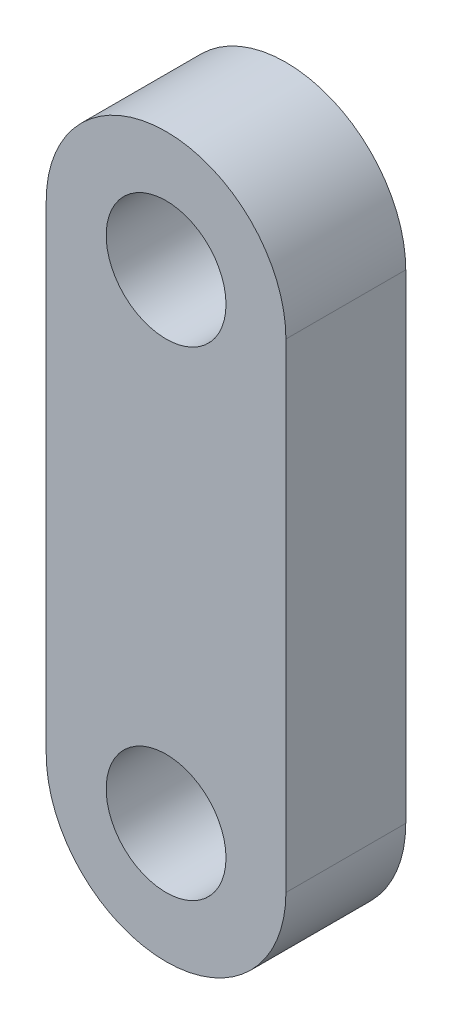
ISO-10303-21;
HEADER;
FILE_DESCRIPTION(('STEP AP214'),'2;1');
FILE_NAME('part.step','',(''),(''),'','','');
FILE_SCHEMA(('AUTOMOTIVE_DESIGN { 1 0 10303 214 1 1 1 1 }'));
ENDSEC;
DATA;
#1=APPLICATION_CONTEXT('core data for automotive mechanical design processes');
#2=APPLICATION_PROTOCOL_DEFINITION('international standard','automotive_design',2000,#1);
#3=PRODUCT_CONTEXT('',#1,'mechanical');
#4=PRODUCT('Part','Part','',(#3));
#5=PRODUCT_RELATED_PRODUCT_CATEGORY('part','',(#4));
#6=PRODUCT_DEFINITION_FORMATION('','',#4);
#7=PRODUCT_DEFINITION_CONTEXT('part definition',#1,'design');
#8=PRODUCT_DEFINITION('design','',#6,#7);
#9=PRODUCT_DEFINITION_SHAPE('','',#8);
#10=(LENGTH_UNIT() NAMED_UNIT(*) SI_UNIT(.MILLI.,.METRE.));
#11=(NAMED_UNIT(*) PLANE_ANGLE_UNIT() SI_UNIT($,.RADIAN.));
#12=(NAMED_UNIT(*) SI_UNIT($,.STERADIAN.) SOLID_ANGLE_UNIT());
#13=UNCERTAINTY_MEASURE_WITH_UNIT(LENGTH_MEASURE(1.E-05),#10,'distance_accuracy_value','');
#14=(GEOMETRIC_REPRESENTATION_CONTEXT(3) GLOBAL_UNCERTAINTY_ASSIGNED_CONTEXT((#13)) GLOBAL_UNIT_ASSIGNED_CONTEXT((#10,
#11,#12)) REPRESENTATION_CONTEXT('',''));
#15=CARTESIAN_POINT('',(0.,0.,0.));
#16=DIRECTION('',(0.,0.,1.));
#17=DIRECTION('',(1.,0.,0.));
#18=AXIS2_PLACEMENT_3D('',#15,#16,#17);
#19=CARTESIAN_POINT('',(0.,25.4,6.35));
#20=DIRECTION('',(0.,0.,1.));
#21=DIRECTION('',(1.,0.,0.));
#22=AXIS2_PLACEMENT_3D('',#19,#20,#21);
#23=PLANE('',#22);
#24=CARTESIAN_POINT('',(0.,0.,6.35));
#25=DIRECTION('',(0.,0.,1.));
#26=DIRECTION('',(1.,0.,0.));
#27=AXIS2_PLACEMENT_3D('',#24,#25,#26);
#28=CIRCLE('',#27,3.175);
#29=CARTESIAN_POINT('',(3.175,0.,6.35));
#30=VERTEX_POINT('',#29);
#31=EDGE_CURVE('E116',#30,#30,#28,.T.);
#32=ORIENTED_EDGE('',*,*,#31,.F.);
#33=EDGE_LOOP('',(#32));
#34=FACE_BOUND('',#33,.T.);
#35=CARTESIAN_POINT('',(0.,25.4,6.35));
#36=DIRECTION('',(0.,0.,1.));
#37=DIRECTION('',(1.,0.,0.));
#38=AXIS2_PLACEMENT_3D('',#35,#36,#37);
#39=CIRCLE('',#38,6.35);
#40=CARTESIAN_POINT('',(6.35,25.4,6.35));
#41=VERTEX_POINT('',#40);
#42=CARTESIAN_POINT('',(-6.35,25.4,6.35));
#43=VERTEX_POINT('',#42);
#44=EDGE_CURVE('E96',#41,#43,#39,.T.);
#45=ORIENTED_EDGE('',*,*,#44,.T.);
#46=DIRECTION('',(0.,-1.,0.));
#47=VECTOR('',#46,1.);
#48=CARTESIAN_POINT('',(-6.35,25.4,6.35));
#49=LINE('',#48,#47);
#50=CARTESIAN_POINT('',(-6.35,0.,6.35));
#51=VERTEX_POINT('',#50);
#52=EDGE_CURVE('E91',#43,#51,#49,.T.);
#53=ORIENTED_EDGE('',*,*,#52,.T.);
#54=CARTESIAN_POINT('',(0.,0.,6.35));
#55=DIRECTION('',(0.,0.,1.));
#56=DIRECTION('',(1.,0.,0.));
#57=AXIS2_PLACEMENT_3D('',#54,#55,#56);
#58=CIRCLE('',#57,6.35);
#59=CARTESIAN_POINT('',(6.35,0.,6.35));
#60=VERTEX_POINT('',#59);
#61=EDGE_CURVE('E94',#51,#60,#58,.T.);
#62=ORIENTED_EDGE('',*,*,#61,.T.);
#63=DIRECTION('',(0.,1.,0.));
#64=VECTOR('',#63,1.);
#65=CARTESIAN_POINT('',(6.35,25.4,6.35));
#66=LINE('',#65,#64);
#67=EDGE_CURVE('E61',#60,#41,#66,.T.);
#68=ORIENTED_EDGE('',*,*,#67,.T.);
#69=EDGE_LOOP('',(#45,#53,#62,#68));
#70=FACE_BOUND('',#69,.T.);
#71=CARTESIAN_POINT('',(0.,25.4,6.35));
#72=DIRECTION('',(0.,0.,1.));
#73=DIRECTION('',(1.,0.,0.));
#74=AXIS2_PLACEMENT_3D('',#71,#72,#73);
#75=CIRCLE('',#74,3.175);
#76=CARTESIAN_POINT('',(3.175,25.4,6.35));
#77=VERTEX_POINT('',#76);
#78=EDGE_CURVE('E138',#77,#77,#75,.T.);
#79=ORIENTED_EDGE('',*,*,#78,.F.);
#80=EDGE_LOOP('',(#79));
#81=FACE_BOUND('',#80,.T.);
#82=ADVANCED_FACE('F43',(#34,#70,#81),#23,.T.);
#83=CARTESIAN_POINT('',(0.,25.4,0.));
#84=DIRECTION('',(0.,0.,1.));
#85=DIRECTION('',(1.,0.,0.));
#86=AXIS2_PLACEMENT_3D('',#83,#84,#85);
#87=PLANE('',#86);
#88=CARTESIAN_POINT('',(0.,25.4,0.));
#89=DIRECTION('',(0.,0.,1.));
#90=DIRECTION('',(1.,0.,0.));
#91=AXIS2_PLACEMENT_3D('',#88,#89,#90);
#92=CIRCLE('',#91,6.35);
#93=CARTESIAN_POINT('',(6.35,25.4,0.));
#94=VERTEX_POINT('',#93);
#95=CARTESIAN_POINT('',(-6.35,25.4,0.));
#96=VERTEX_POINT('',#95);
#97=EDGE_CURVE('E112',#94,#96,#92,.T.);
#98=ORIENTED_EDGE('',*,*,#97,.F.);
#99=DIRECTION('',(0.,1.,0.));
#100=VECTOR('',#99,1.);
#101=CARTESIAN_POINT('',(6.35,25.4,0.));
#102=LINE('',#101,#100);
#103=CARTESIAN_POINT('',(6.35,0.,0.));
#104=VERTEX_POINT('',#103);
#105=EDGE_CURVE('E84',#104,#94,#102,.T.);
#106=ORIENTED_EDGE('',*,*,#105,.F.);
#107=CARTESIAN_POINT('',(0.,0.,0.));
#108=DIRECTION('',(0.,0.,1.));
#109=DIRECTION('',(1.,0.,0.));
#110=AXIS2_PLACEMENT_3D('',#107,#108,#109);
#111=CIRCLE('',#110,6.35);
#112=CARTESIAN_POINT('',(-6.35,0.,0.));
#113=VERTEX_POINT('',#112);
#114=EDGE_CURVE('E78',#113,#104,#111,.T.);
#115=ORIENTED_EDGE('',*,*,#114,.F.);
#116=DIRECTION('',(0.,-1.,0.));
#117=VECTOR('',#116,1.);
#118=CARTESIAN_POINT('',(-6.35,25.4,0.));
#119=LINE('',#118,#117);
#120=EDGE_CURVE('E101',#96,#113,#119,.T.);
#121=ORIENTED_EDGE('',*,*,#120,.F.);
#122=EDGE_LOOP('',(#98,#106,#115,#121));
#123=FACE_BOUND('',#122,.T.);
#124=CARTESIAN_POINT('',(0.,0.,0.));
#125=DIRECTION('',(0.,0.,1.));
#126=DIRECTION('',(1.,0.,0.));
#127=AXIS2_PLACEMENT_3D('',#124,#125,#126);
#128=CIRCLE('',#127,3.175);
#129=CARTESIAN_POINT('',(3.175,0.,0.));
#130=VERTEX_POINT('',#129);
#131=EDGE_CURVE('E134',#130,#130,#128,.T.);
#132=ORIENTED_EDGE('',*,*,#131,.T.);
#133=EDGE_LOOP('',(#132));
#134=FACE_BOUND('',#133,.T.);
#135=CARTESIAN_POINT('',(0.,25.4,0.));
#136=DIRECTION('',(0.,0.,1.));
#137=DIRECTION('',(1.,0.,0.));
#138=AXIS2_PLACEMENT_3D('',#135,#136,#137);
#139=CIRCLE('',#138,3.175);
#140=CARTESIAN_POINT('',(3.175,25.4,0.));
#141=VERTEX_POINT('',#140);
#142=EDGE_CURVE('E142',#141,#141,#139,.T.);
#143=ORIENTED_EDGE('',*,*,#142,.T.);
#144=EDGE_LOOP('',(#143));
#145=FACE_BOUND('',#144,.T.);
#146=ADVANCED_FACE('F129',(#123,#134,#145),#87,.F.);
#147=CARTESIAN_POINT('',(0.,25.4,6.35));
#148=DIRECTION('',(0.,0.,-1.));
#149=DIRECTION('',(-1.,0.,0.));
#150=AXIS2_PLACEMENT_3D('',#147,#148,#149);
#151=CYLINDRICAL_SURFACE('',#150,6.35);
#152=ORIENTED_EDGE('',*,*,#97,.T.);
#153=DIRECTION('',(0.,0.,-1.));
#154=VECTOR('',#153,1.);
#155=CARTESIAN_POINT('',(-6.35,25.4,6.35));
#156=LINE('',#155,#154);
#157=EDGE_CURVE('E11',#43,#96,#156,.T.);
#158=ORIENTED_EDGE('',*,*,#157,.F.);
#159=ORIENTED_EDGE('',*,*,#44,.F.);
#160=DIRECTION('',(0.,0.,-1.));
#161=VECTOR('',#160,1.);
#162=CARTESIAN_POINT('',(6.35,25.4,6.35));
#163=LINE('',#162,#161);
#164=EDGE_CURVE('E108',#41,#94,#163,.T.);
#165=ORIENTED_EDGE('',*,*,#164,.T.);
#166=EDGE_LOOP('',(#152,#158,#159,#165));
#167=FACE_BOUND('',#166,.T.);
#168=ADVANCED_FACE('F45',(#167),#151,.T.);
#169=CARTESIAN_POINT('',(-6.35,25.4,6.35));
#170=DIRECTION('',(1.,0.,0.));
#171=DIRECTION('',(0.,0.,-1.));
#172=AXIS2_PLACEMENT_3D('',#169,#170,#171);
#173=PLANE('',#172);
#174=ORIENTED_EDGE('',*,*,#120,.T.);
#175=DIRECTION('',(0.,0.,-1.));
#176=VECTOR('',#175,1.);
#177=CARTESIAN_POINT('',(-6.35,0.,6.35));
#178=LINE('',#177,#176);
#179=EDGE_CURVE('E53',#51,#113,#178,.T.);
#180=ORIENTED_EDGE('',*,*,#179,.F.);
#181=ORIENTED_EDGE('',*,*,#52,.F.);
#182=ORIENTED_EDGE('',*,*,#157,.T.);
#183=EDGE_LOOP('',(#174,#180,#181,#182));
#184=FACE_BOUND('',#183,.T.);
#185=ADVANCED_FACE('F100',(#184),#173,.F.);
#186=CARTESIAN_POINT('',(0.,0.,6.35));
#187=DIRECTION('',(0.,0.,-1.));
#188=DIRECTION('',(-1.,0.,0.));
#189=AXIS2_PLACEMENT_3D('',#186,#187,#188);
#190=CYLINDRICAL_SURFACE('',#189,6.35);
#191=ORIENTED_EDGE('',*,*,#114,.T.);
#192=DIRECTION('',(0.,0.,-1.));
#193=VECTOR('',#192,1.);
#194=CARTESIAN_POINT('',(6.35,0.,6.35));
#195=LINE('',#194,#193);
#196=EDGE_CURVE('E103',#60,#104,#195,.T.);
#197=ORIENTED_EDGE('',*,*,#196,.F.);
#198=ORIENTED_EDGE('',*,*,#61,.F.);
#199=ORIENTED_EDGE('',*,*,#179,.T.);
#200=EDGE_LOOP('',(#191,#197,#198,#199));
#201=FACE_BOUND('',#200,.T.);
#202=ADVANCED_FACE('F104',(#201),#190,.T.);
#203=CARTESIAN_POINT('',(6.35,25.4,6.35));
#204=DIRECTION('',(-1.,0.,0.));
#205=DIRECTION('',(0.,0.,1.));
#206=AXIS2_PLACEMENT_3D('',#203,#204,#205);
#207=PLANE('',#206);
#208=ORIENTED_EDGE('',*,*,#105,.T.);
#209=ORIENTED_EDGE('',*,*,#164,.F.);
#210=ORIENTED_EDGE('',*,*,#67,.F.);
#211=ORIENTED_EDGE('',*,*,#196,.T.);
#212=EDGE_LOOP('',(#208,#209,#210,#211));
#213=FACE_BOUND('',#212,.T.);
#214=ADVANCED_FACE('F126',(#213),#207,.F.);
#215=CARTESIAN_POINT('',(0.,0.,6.35));
#216=DIRECTION('',(0.,0.,-1.));
#217=DIRECTION('',(-1.,0.,0.));
#218=AXIS2_PLACEMENT_3D('',#215,#216,#217);
#219=CYLINDRICAL_SURFACE('',#218,3.175);
#220=ORIENTED_EDGE('',*,*,#31,.T.);
#221=EDGE_LOOP('',(#220));
#222=FACE_BOUND('',#221,.T.);
#223=ORIENTED_EDGE('',*,*,#131,.F.);
#224=EDGE_LOOP('',(#223));
#225=FACE_BOUND('',#224,.T.);
#226=ADVANCED_FACE('F161',(#222,#225),#219,.F.);
#227=CARTESIAN_POINT('',(0.,25.4,6.35));
#228=DIRECTION('',(0.,0.,-1.));
#229=DIRECTION('',(-1.,0.,0.));
#230=AXIS2_PLACEMENT_3D('',#227,#228,#229);
#231=CYLINDRICAL_SURFACE('',#230,3.175);
#232=ORIENTED_EDGE('',*,*,#78,.T.);
#233=EDGE_LOOP('',(#232));
#234=FACE_BOUND('',#233,.T.);
#235=ORIENTED_EDGE('',*,*,#142,.F.);
#236=EDGE_LOOP('',(#235));
#237=FACE_BOUND('',#236,.T.);
#238=ADVANCED_FACE('F150',(#234,#237),#231,.F.);
#239=CLOSED_SHELL('',(#82,#146,#168,#185,#202,#214,#226,#238));
#240=MANIFOLD_SOLID_BREP('B2',#239);
#241=ADVANCED_BREP_SHAPE_REPRESENTATION('',(#18,#240),#14);
#242=SHAPE_DEFINITION_REPRESENTATION(#9,#241);
ENDSEC;
END-ISO-10303-21;
